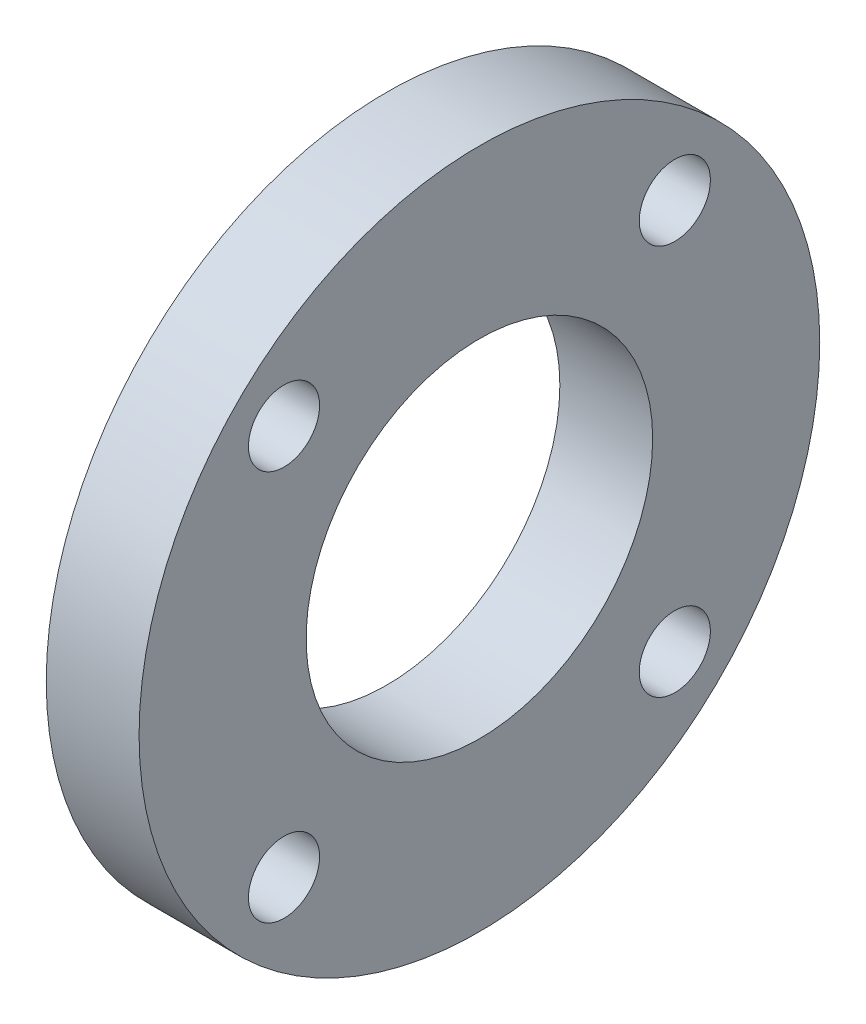
ISO-10303-21;
HEADER;
FILE_DESCRIPTION(('STEP AP214'),'2;1');
FILE_NAME('part.step','',(''),(''),'','','');
FILE_SCHEMA(('AUTOMOTIVE_DESIGN { 1 0 10303 214 1 1 1 1 }'));
ENDSEC;
DATA;
#1=APPLICATION_CONTEXT('core data for automotive mechanical design processes');
#2=APPLICATION_PROTOCOL_DEFINITION('international standard','automotive_design',2000,#1);
#3=PRODUCT_CONTEXT('',#1,'mechanical');
#4=PRODUCT('Part','Part','',(#3));
#5=PRODUCT_RELATED_PRODUCT_CATEGORY('part','',(#4));
#6=PRODUCT_DEFINITION_FORMATION('','',#4);
#7=PRODUCT_DEFINITION_CONTEXT('part definition',#1,'design');
#8=PRODUCT_DEFINITION('design','',#6,#7);
#9=PRODUCT_DEFINITION_SHAPE('','',#8);
#10=(LENGTH_UNIT() NAMED_UNIT(*) SI_UNIT(.MILLI.,.METRE.));
#11=(NAMED_UNIT(*) PLANE_ANGLE_UNIT() SI_UNIT($,.RADIAN.));
#12=(NAMED_UNIT(*) SI_UNIT($,.STERADIAN.) SOLID_ANGLE_UNIT());
#13=UNCERTAINTY_MEASURE_WITH_UNIT(LENGTH_MEASURE(1.E-05),#10,'distance_accuracy_value','');
#14=(GEOMETRIC_REPRESENTATION_CONTEXT(3) GLOBAL_UNCERTAINTY_ASSIGNED_CONTEXT((#13)) GLOBAL_UNIT_ASSIGNED_CONTEXT((#10,
#11,#12)) REPRESENTATION_CONTEXT('',''));
#15=CARTESIAN_POINT('',(0.,0.,0.));
#16=DIRECTION('',(0.,0.,1.));
#17=DIRECTION('',(1.,0.,0.));
#18=AXIS2_PLACEMENT_3D('',#15,#16,#17);
#19=CARTESIAN_POINT('',(3.,0.,0.));
#20=DIRECTION('',(1.,0.,0.));
#21=DIRECTION('',(0.,0.,-1.));
#22=AXIS2_PLACEMENT_3D('',#19,#20,#21);
#23=PLANE('',#22);
#24=CARTESIAN_POINT('',(3.,6.31546517261476,6.31546517261514));
#25=DIRECTION('',(1.,0.,0.));
#26=DIRECTION('',(0.,0.,-1.));
#27=AXIS2_PLACEMENT_3D('',#24,#25,#26);
#28=CIRCLE('',#27,1.15);
#29=CARTESIAN_POINT('',(3.,6.31546517261476,5.16546517261514));
#30=VERTEX_POINT('',#29);
#31=EDGE_CURVE('E74',#30,#30,#28,.T.);
#32=ORIENTED_EDGE('',*,*,#31,.F.);
#33=EDGE_LOOP('',(#32));
#34=FACE_BOUND('',#33,.T.);
#35=CARTESIAN_POINT('',(3.,-6.31546517261549,6.31546517261476));
#36=DIRECTION('',(1.,0.,0.));
#37=DIRECTION('',(0.,0.,-1.));
#38=AXIS2_PLACEMENT_3D('',#35,#36,#37);
#39=CIRCLE('',#38,1.15);
#40=CARTESIAN_POINT('',(3.,-6.31546517261549,5.16546517261476));
#41=VERTEX_POINT('',#40);
#42=EDGE_CURVE('E82',#41,#41,#39,.T.);
#43=ORIENTED_EDGE('',*,*,#42,.F.);
#44=EDGE_LOOP('',(#43));
#45=FACE_BOUND('',#44,.T.);
#46=CARTESIAN_POINT('',(3.,-6.31546517261511,-6.31546517261549));
#47=DIRECTION('',(1.,0.,0.));
#48=DIRECTION('',(0.,0.,-1.));
#49=AXIS2_PLACEMENT_3D('',#46,#47,#48);
#50=CIRCLE('',#49,1.15);
#51=CARTESIAN_POINT('',(3.,-6.31546517261511,-7.46546517261549));
#52=VERTEX_POINT('',#51);
#53=EDGE_CURVE('E90',#52,#52,#50,.T.);
#54=ORIENTED_EDGE('',*,*,#53,.F.);
#55=EDGE_LOOP('',(#54));
#56=FACE_BOUND('',#55,.T.);
#57=CARTESIAN_POINT('',(3.,6.31546517261514,-6.31546517261511));
#58=DIRECTION('',(1.,0.,0.));
#59=DIRECTION('',(0.,0.,-1.));
#60=AXIS2_PLACEMENT_3D('',#57,#58,#59);
#61=CIRCLE('',#60,1.15);
#62=CARTESIAN_POINT('',(3.,6.31546517261514,-7.46546517261511));
#63=VERTEX_POINT('',#62);
#64=EDGE_CURVE('E62',#63,#63,#61,.T.);
#65=ORIENTED_EDGE('',*,*,#64,.F.);
#66=EDGE_LOOP('',(#65));
#67=FACE_BOUND('',#66,.T.);
#68=CARTESIAN_POINT('',(3.,0.,0.));
#69=DIRECTION('',(1.,0.,0.));
#70=DIRECTION('',(0.,0.,-1.));
#71=AXIS2_PLACEMENT_3D('',#68,#69,#70);
#72=CIRCLE('',#71,11.);
#73=CARTESIAN_POINT('',(3.,0.,-11.));
#74=VERTEX_POINT('',#73);
#75=EDGE_CURVE('E10',#74,#74,#72,.T.);
#76=ORIENTED_EDGE('',*,*,#75,.T.);
#77=EDGE_LOOP('',(#76));
#78=FACE_BOUND('',#77,.T.);
#79=CARTESIAN_POINT('',(3.,0.,0.));
#80=DIRECTION('',(1.,0.,0.));
#81=DIRECTION('',(0.,0.,-1.));
#82=AXIS2_PLACEMENT_3D('',#79,#80,#81);
#83=CIRCLE('',#82,5.6);
#84=CARTESIAN_POINT('',(3.,0.,-5.6));
#85=VERTEX_POINT('',#84);
#86=EDGE_CURVE('E56',#85,#85,#83,.T.);
#87=ORIENTED_EDGE('',*,*,#86,.F.);
#88=EDGE_LOOP('',(#87));
#89=FACE_BOUND('',#88,.T.);
#90=ADVANCED_FACE('F43',(#34,#45,#56,#67,#78,#89),#23,.T.);
#91=CARTESIAN_POINT('',(0.,0.,0.));
#92=DIRECTION('',(1.,0.,0.));
#93=DIRECTION('',(0.,0.,-1.));
#94=AXIS2_PLACEMENT_3D('',#91,#92,#93);
#95=PLANE('',#94);
#96=CARTESIAN_POINT('',(0.,6.31546517261476,6.31546517261514));
#97=DIRECTION('',(1.,0.,0.));
#98=DIRECTION('',(0.,0.,-1.));
#99=AXIS2_PLACEMENT_3D('',#96,#97,#98);
#100=CIRCLE('',#99,1.15);
#101=CARTESIAN_POINT('',(0.,6.31546517261476,5.16546517261514));
#102=VERTEX_POINT('',#101);
#103=EDGE_CURVE('E78',#102,#102,#100,.T.);
#104=ORIENTED_EDGE('',*,*,#103,.T.);
#105=EDGE_LOOP('',(#104));
#106=FACE_BOUND('',#105,.T.);
#107=CARTESIAN_POINT('',(0.,-6.31546517261549,6.31546517261476));
#108=DIRECTION('',(1.,0.,0.));
#109=DIRECTION('',(0.,0.,-1.));
#110=AXIS2_PLACEMENT_3D('',#107,#108,#109);
#111=CIRCLE('',#110,1.15);
#112=CARTESIAN_POINT('',(0.,-6.31546517261549,5.16546517261476));
#113=VERTEX_POINT('',#112);
#114=EDGE_CURVE('E86',#113,#113,#111,.T.);
#115=ORIENTED_EDGE('',*,*,#114,.T.);
#116=EDGE_LOOP('',(#115));
#117=FACE_BOUND('',#116,.T.);
#118=CARTESIAN_POINT('',(0.,-6.31546517261511,-6.31546517261549));
#119=DIRECTION('',(1.,0.,0.));
#120=DIRECTION('',(0.,0.,-1.));
#121=AXIS2_PLACEMENT_3D('',#118,#119,#120);
#122=CIRCLE('',#121,1.15);
#123=CARTESIAN_POINT('',(0.,-6.31546517261511,-7.46546517261549));
#124=VERTEX_POINT('',#123);
#125=EDGE_CURVE('E70',#124,#124,#122,.T.);
#126=ORIENTED_EDGE('',*,*,#125,.T.);
#127=EDGE_LOOP('',(#126));
#128=FACE_BOUND('',#127,.T.);
#129=CARTESIAN_POINT('',(0.,6.31546517261514,-6.31546517261511));
#130=DIRECTION('',(1.,0.,0.));
#131=DIRECTION('',(0.,0.,-1.));
#132=AXIS2_PLACEMENT_3D('',#129,#130,#131);
#133=CIRCLE('',#132,1.15);
#134=CARTESIAN_POINT('',(0.,6.31546517261514,-7.46546517261511));
#135=VERTEX_POINT('',#134);
#136=EDGE_CURVE('E66',#135,#135,#133,.T.);
#137=ORIENTED_EDGE('',*,*,#136,.T.);
#138=EDGE_LOOP('',(#137));
#139=FACE_BOUND('',#138,.T.);
#140=CARTESIAN_POINT('',(0.,0.,0.));
#141=DIRECTION('',(1.,0.,0.));
#142=DIRECTION('',(0.,0.,-1.));
#143=AXIS2_PLACEMENT_3D('',#140,#141,#142);
#144=CIRCLE('',#143,11.);
#145=CARTESIAN_POINT('',(0.,0.,-11.));
#146=VERTEX_POINT('',#145);
#147=EDGE_CURVE('E47',#146,#146,#144,.T.);
#148=ORIENTED_EDGE('',*,*,#147,.F.);
#149=EDGE_LOOP('',(#148));
#150=FACE_BOUND('',#149,.T.);
#151=CARTESIAN_POINT('',(0.,0.,0.));
#152=DIRECTION('',(1.,0.,0.));
#153=DIRECTION('',(0.,0.,-1.));
#154=AXIS2_PLACEMENT_3D('',#151,#152,#153);
#155=CIRCLE('',#154,5.6);
#156=CARTESIAN_POINT('',(0.,0.,-5.6));
#157=VERTEX_POINT('',#156);
#158=EDGE_CURVE('E58',#157,#157,#155,.T.);
#159=ORIENTED_EDGE('',*,*,#158,.T.);
#160=EDGE_LOOP('',(#159));
#161=FACE_BOUND('',#160,.T.);
#162=ADVANCED_FACE('F98',(#106,#117,#128,#139,#150,#161),#95,.F.);
#163=CARTESIAN_POINT('',(3.,0.,0.));
#164=DIRECTION('',(-1.,0.,0.));
#165=DIRECTION('',(0.,0.,1.));
#166=AXIS2_PLACEMENT_3D('',#163,#164,#165);
#167=CYLINDRICAL_SURFACE('',#166,11.);
#168=ORIENTED_EDGE('',*,*,#75,.F.);
#169=EDGE_LOOP('',(#168));
#170=FACE_BOUND('',#169,.T.);
#171=ORIENTED_EDGE('',*,*,#147,.T.);
#172=EDGE_LOOP('',(#171));
#173=FACE_BOUND('',#172,.T.);
#174=ADVANCED_FACE('F45',(#170,#173),#167,.T.);
#175=CARTESIAN_POINT('',(3.,0.,0.));
#176=DIRECTION('',(-1.,0.,0.));
#177=DIRECTION('',(0.,0.,1.));
#178=AXIS2_PLACEMENT_3D('',#175,#176,#177);
#179=CYLINDRICAL_SURFACE('',#178,5.6);
#180=ORIENTED_EDGE('',*,*,#86,.T.);
#181=EDGE_LOOP('',(#180));
#182=FACE_BOUND('',#181,.T.);
#183=ORIENTED_EDGE('',*,*,#158,.F.);
#184=EDGE_LOOP('',(#183));
#185=FACE_BOUND('',#184,.T.);
#186=ADVANCED_FACE('F114',(#182,#185),#179,.F.);
#187=CARTESIAN_POINT('',(3.,6.31546517261514,-6.31546517261511));
#188=DIRECTION('',(-1.,0.,0.));
#189=DIRECTION('',(0.,0.,1.));
#190=AXIS2_PLACEMENT_3D('',#187,#188,#189);
#191=CYLINDRICAL_SURFACE('',#190,1.15);
#192=ORIENTED_EDGE('',*,*,#64,.T.);
#193=EDGE_LOOP('',(#192));
#194=FACE_BOUND('',#193,.T.);
#195=ORIENTED_EDGE('',*,*,#136,.F.);
#196=EDGE_LOOP('',(#195));
#197=FACE_BOUND('',#196,.T.);
#198=ADVANCED_FACE('F104',(#194,#197),#191,.F.);
#199=CARTESIAN_POINT('',(3.,-6.31546517261511,-6.31546517261549));
#200=DIRECTION('',(-1.,0.,0.));
#201=DIRECTION('',(0.,0.,1.));
#202=AXIS2_PLACEMENT_3D('',#199,#200,#201);
#203=CYLINDRICAL_SURFACE('',#202,1.15);
#204=ORIENTED_EDGE('',*,*,#53,.T.);
#205=EDGE_LOOP('',(#204));
#206=FACE_BOUND('',#205,.T.);
#207=ORIENTED_EDGE('',*,*,#125,.F.);
#208=EDGE_LOOP('',(#207));
#209=FACE_BOUND('',#208,.T.);
#210=ADVANCED_FACE('F101',(#206,#209),#203,.F.);
#211=CARTESIAN_POINT('',(3.,-6.31546517261549,6.31546517261476));
#212=DIRECTION('',(-1.,0.,0.));
#213=DIRECTION('',(0.,0.,1.));
#214=AXIS2_PLACEMENT_3D('',#211,#212,#213);
#215=CYLINDRICAL_SURFACE('',#214,1.15);
#216=ORIENTED_EDGE('',*,*,#42,.T.);
#217=EDGE_LOOP('',(#216));
#218=FACE_BOUND('',#217,.T.);
#219=ORIENTED_EDGE('',*,*,#114,.F.);
#220=EDGE_LOOP('',(#219));
#221=FACE_BOUND('',#220,.T.);
#222=ADVANCED_FACE('F103',(#218,#221),#215,.F.);
#223=CARTESIAN_POINT('',(3.,6.31546517261476,6.31546517261514));
#224=DIRECTION('',(-1.,0.,0.));
#225=DIRECTION('',(0.,0.,1.));
#226=AXIS2_PLACEMENT_3D('',#223,#224,#225);
#227=CYLINDRICAL_SURFACE('',#226,1.15);
#228=ORIENTED_EDGE('',*,*,#31,.T.);
#229=EDGE_LOOP('',(#228));
#230=FACE_BOUND('',#229,.T.);
#231=ORIENTED_EDGE('',*,*,#103,.F.);
#232=EDGE_LOOP('',(#231));
#233=FACE_BOUND('',#232,.T.);
#234=ADVANCED_FACE('F111',(#230,#233),#227,.F.);
#235=CLOSED_SHELL('',(#90,#162,#174,#186,#198,#210,#222,#234));
#236=MANIFOLD_SOLID_BREP('B2',#235);
#237=ADVANCED_BREP_SHAPE_REPRESENTATION('',(#18,#236),#14);
#238=SHAPE_DEFINITION_REPRESENTATION(#9,#237);
ENDSEC;
END-ISO-10303-21;
